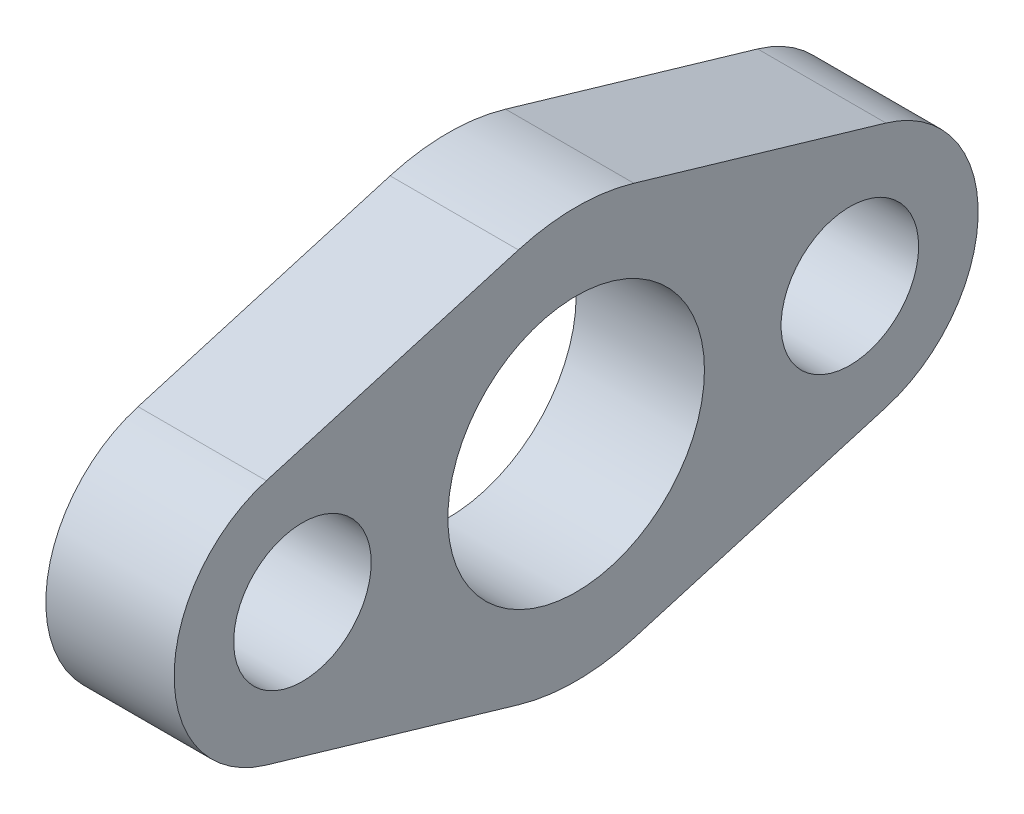
ISO-10303-21;
HEADER;
FILE_DESCRIPTION(('STEP AP214'),'2;1');
FILE_NAME('part.step','',(''),(''),'','','');
FILE_SCHEMA(('AUTOMOTIVE_DESIGN { 1 0 10303 214 1 1 1 1 }'));
ENDSEC;
DATA;
#1=APPLICATION_CONTEXT('core data for automotive mechanical design processes');
#2=APPLICATION_PROTOCOL_DEFINITION('international standard','automotive_design',2000,#1);
#3=PRODUCT_CONTEXT('',#1,'mechanical');
#4=PRODUCT('Part','Part','',(#3));
#5=PRODUCT_RELATED_PRODUCT_CATEGORY('part','',(#4));
#6=PRODUCT_DEFINITION_FORMATION('','',#4);
#7=PRODUCT_DEFINITION_CONTEXT('part definition',#1,'design');
#8=PRODUCT_DEFINITION('design','',#6,#7);
#9=PRODUCT_DEFINITION_SHAPE('','',#8);
#10=(LENGTH_UNIT() NAMED_UNIT(*) SI_UNIT(.MILLI.,.METRE.));
#11=(NAMED_UNIT(*) PLANE_ANGLE_UNIT() SI_UNIT($,.RADIAN.));
#12=(NAMED_UNIT(*) SI_UNIT($,.STERADIAN.) SOLID_ANGLE_UNIT());
#13=UNCERTAINTY_MEASURE_WITH_UNIT(LENGTH_MEASURE(1.E-05),#10,'distance_accuracy_value','');
#14=(GEOMETRIC_REPRESENTATION_CONTEXT(3) GLOBAL_UNCERTAINTY_ASSIGNED_CONTEXT((#13)) GLOBAL_UNIT_ASSIGNED_CONTEXT((#10,
#11,#12)) REPRESENTATION_CONTEXT('',''));
#15=CARTESIAN_POINT('',(0.,0.,0.));
#16=DIRECTION('',(0.,0.,1.));
#17=DIRECTION('',(1.,0.,0.));
#18=AXIS2_PLACEMENT_3D('',#15,#16,#17);
#19=CARTESIAN_POINT('',(-1.58749999999999,25.4,-139.32677028468));
#20=DIRECTION('',(1.,0.,0.));
#21=DIRECTION('',(0.,0.,-1.));
#22=AXIS2_PLACEMENT_3D('',#19,#20,#21);
#23=PLANE('',#22);
#24=CARTESIAN_POINT('',(-1.58749999999999,25.4,-139.32677028468));
#25=DIRECTION('',(-1.,0.,0.));
#26=DIRECTION('',(0.,0.,-1.));
#27=AXIS2_PLACEMENT_3D('',#24,#25,#26);
#28=CIRCLE('',#27,7.62000000000001);
#29=CARTESIAN_POINT('',(-1.58749999999999,32.7124151437384,-137.18364528468));
#30=VERTEX_POINT('',#29);
#31=CARTESIAN_POINT('',(-1.58749999999999,32.7124151437384,-141.46989528468));
#32=VERTEX_POINT('',#31);
#33=EDGE_CURVE('E155',#30,#32,#28,.T.);
#34=ORIENTED_EDGE('',*,*,#33,.T.);
#35=DIRECTION('',(0.,-0.28125,-0.959634533299005));
#36=VECTOR('',#35,1.);
#37=CARTESIAN_POINT('',(-1.58749999999999,29.9702594648365,-150.82622340968));
#38=LINE('',#37,#36);
#39=CARTESIAN_POINT('',(-1.58749999999999,29.9702594648365,-150.82622340968));
#40=VERTEX_POINT('',#39);
#41=EDGE_CURVE('E181',#32,#40,#38,.T.);
#42=ORIENTED_EDGE('',*,*,#41,.T.);
#43=CARTESIAN_POINT('',(-1.58749999999999,25.4,-149.48677028468));
#44=DIRECTION('',(-1.,0.,0.));
#45=DIRECTION('',(0.,0.,-1.));
#46=AXIS2_PLACEMENT_3D('',#43,#44,#45);
#47=CIRCLE('',#46,4.7625);
#48=CARTESIAN_POINT('',(-1.58749999999999,20.8297405351635,-150.82622340968));
#49=VERTEX_POINT('',#48);
#50=EDGE_CURVE('E168',#40,#49,#47,.T.);
#51=ORIENTED_EDGE('',*,*,#50,.T.);
#52=DIRECTION('',(0.,-0.28125,0.959634533299005));
#53=VECTOR('',#52,1.);
#54=CARTESIAN_POINT('',(-1.58749999999999,18.0875848562616,-141.46989528468));
#55=LINE('',#54,#53);
#56=CARTESIAN_POINT('',(-1.58749999999999,18.0875848562616,-141.46989528468));
#57=VERTEX_POINT('',#56);
#58=EDGE_CURVE('E130',#49,#57,#55,.T.);
#59=ORIENTED_EDGE('',*,*,#58,.T.);
#60=CARTESIAN_POINT('',(-1.58749999999999,25.4,-139.32677028468));
#61=DIRECTION('',(-1.,0.,0.));
#62=DIRECTION('',(0.,0.,-1.));
#63=AXIS2_PLACEMENT_3D('',#60,#61,#62);
#64=CIRCLE('',#63,7.62);
#65=CARTESIAN_POINT('',(-1.58749999999999,18.0875848562616,-137.18364528468));
#66=VERTEX_POINT('',#65);
#67=EDGE_CURVE('E128',#57,#66,#64,.T.);
#68=ORIENTED_EDGE('',*,*,#67,.T.);
#69=DIRECTION('',(0.,0.281249999999999,0.959634533299006));
#70=VECTOR('',#69,1.);
#71=CARTESIAN_POINT('',(-1.58749999999999,20.8297405351635,-127.82731715968));
#72=LINE('',#71,#70);
#73=CARTESIAN_POINT('',(-1.58749999999999,20.8297405351635,-127.82731715968));
#74=VERTEX_POINT('',#73);
#75=EDGE_CURVE('E110',#66,#74,#72,.T.);
#76=ORIENTED_EDGE('',*,*,#75,.T.);
#77=CARTESIAN_POINT('',(-1.58749999999999,25.4,-129.16677028468));
#78=DIRECTION('',(-1.,0.,0.));
#79=DIRECTION('',(0.,0.,-1.));
#80=AXIS2_PLACEMENT_3D('',#77,#78,#79);
#81=CIRCLE('',#80,4.7625);
#82=CARTESIAN_POINT('',(-1.58749999999999,29.9702594648365,-127.82731715968));
#83=VERTEX_POINT('',#82);
#84=EDGE_CURVE('E119',#74,#83,#81,.T.);
#85=ORIENTED_EDGE('',*,*,#84,.T.);
#86=DIRECTION('',(0.,0.281250000000001,-0.959634533299005));
#87=VECTOR('',#86,1.);
#88=CARTESIAN_POINT('',(-1.58749999999999,32.7124151437384,-137.18364528468));
#89=LINE('',#88,#87);
#90=EDGE_CURVE('E122',#83,#30,#89,.T.);
#91=ORIENTED_EDGE('',*,*,#90,.T.);
#92=EDGE_LOOP('',(#34,#42,#51,#59,#68,#76,#85,#91));
#93=FACE_BOUND('',#92,.T.);
#94=CARTESIAN_POINT('',(-1.58749999999999,25.4,-139.32677028468));
#95=DIRECTION('',(-1.,0.,0.));
#96=DIRECTION('',(0.,0.,1.));
#97=AXIS2_PLACEMENT_3D('',#94,#95,#96);
#98=CIRCLE('',#97,4.76250000000001);
#99=CARTESIAN_POINT('',(-1.58749999999999,25.4,-144.08927028468));
#100=VERTEX_POINT('',#99);
#101=EDGE_CURVE('E138',#100,#100,#98,.T.);
#102=ORIENTED_EDGE('',*,*,#101,.F.);
#103=EDGE_LOOP('',(#102));
#104=FACE_BOUND('',#103,.T.);
#105=CARTESIAN_POINT('',(-1.58749999999999,25.4,-149.48677028468));
#106=DIRECTION('',(-1.,0.,0.));
#107=DIRECTION('',(0.,0.,1.));
#108=AXIS2_PLACEMENT_3D('',#105,#106,#107);
#109=CIRCLE('',#108,2.55269999999998);
#110=CARTESIAN_POINT('',(-1.58749999999999,25.4,-152.03947028468));
#111=VERTEX_POINT('',#110);
#112=EDGE_CURVE('E189',#111,#111,#109,.T.);
#113=ORIENTED_EDGE('',*,*,#112,.F.);
#114=EDGE_LOOP('',(#113));
#115=FACE_BOUND('',#114,.T.);
#116=CARTESIAN_POINT('',(-1.58749999999999,25.4,-129.16677028468));
#117=DIRECTION('',(-1.,0.,0.));
#118=DIRECTION('',(0.,0.,1.));
#119=AXIS2_PLACEMENT_3D('',#116,#117,#118);
#120=CIRCLE('',#119,2.55269999999998);
#121=CARTESIAN_POINT('',(-1.58749999999999,25.4,-131.71947028468));
#122=VERTEX_POINT('',#121);
#123=EDGE_CURVE('E195',#122,#122,#120,.T.);
#124=ORIENTED_EDGE('',*,*,#123,.F.);
#125=EDGE_LOOP('',(#124));
#126=FACE_BOUND('',#125,.T.);
#127=ADVANCED_FACE('F39',(#93,#104,#115,#126),#23,.F.);
#128=CARTESIAN_POINT('',(3.17500000000001,25.4,-139.32677028468));
#129=DIRECTION('',(1.,0.,0.));
#130=DIRECTION('',(0.,0.,-1.));
#131=AXIS2_PLACEMENT_3D('',#128,#129,#130);
#132=PLANE('',#131);
#133=CARTESIAN_POINT('',(3.17500000000001,25.4,-149.48677028468));
#134=DIRECTION('',(-1.,0.,0.));
#135=DIRECTION('',(0.,0.,1.));
#136=AXIS2_PLACEMENT_3D('',#133,#134,#135);
#137=CIRCLE('',#136,2.55269999999998);
#138=CARTESIAN_POINT('',(3.17500000000001,25.4,-152.03947028468));
#139=VERTEX_POINT('',#138);
#140=EDGE_CURVE('E192',#139,#139,#137,.T.);
#141=ORIENTED_EDGE('',*,*,#140,.T.);
#142=EDGE_LOOP('',(#141));
#143=FACE_BOUND('',#142,.T.);
#144=CARTESIAN_POINT('',(3.17500000000001,25.4,-139.32677028468));
#145=DIRECTION('',(-1.,0.,0.));
#146=DIRECTION('',(0.,0.,-1.));
#147=AXIS2_PLACEMENT_3D('',#144,#145,#146);
#148=CIRCLE('',#147,7.62000000000001);
#149=CARTESIAN_POINT('',(3.17500000000001,32.7124151437384,-137.18364528468));
#150=VERTEX_POINT('',#149);
#151=CARTESIAN_POINT('',(3.17500000000001,32.7124151437384,-141.46989528468));
#152=VERTEX_POINT('',#151);
#153=EDGE_CURVE('E135',#150,#152,#148,.T.);
#154=ORIENTED_EDGE('',*,*,#153,.F.);
#155=DIRECTION('',(0.,0.281250000000001,-0.959634533299005));
#156=VECTOR('',#155,1.);
#157=CARTESIAN_POINT('',(3.17500000000001,32.7124151437384,-137.18364528468));
#158=LINE('',#157,#156);
#159=CARTESIAN_POINT('',(3.17500000000001,29.9702594648365,-127.82731715968));
#160=VERTEX_POINT('',#159);
#161=EDGE_CURVE('E153',#160,#150,#158,.T.);
#162=ORIENTED_EDGE('',*,*,#161,.F.);
#163=CARTESIAN_POINT('',(3.17500000000001,25.4,-129.16677028468));
#164=DIRECTION('',(-1.,0.,0.));
#165=DIRECTION('',(0.,0.,-1.));
#166=AXIS2_PLACEMENT_3D('',#163,#164,#165);
#167=CIRCLE('',#166,4.7625);
#168=CARTESIAN_POINT('',(3.17500000000001,20.8297405351635,-127.82731715968));
#169=VERTEX_POINT('',#168);
#170=EDGE_CURVE('E151',#169,#160,#167,.T.);
#171=ORIENTED_EDGE('',*,*,#170,.F.);
#172=DIRECTION('',(0.,0.281249999999999,0.959634533299006));
#173=VECTOR('',#172,1.);
#174=CARTESIAN_POINT('',(3.17500000000001,20.8297405351635,-127.82731715968));
#175=LINE('',#174,#173);
#176=CARTESIAN_POINT('',(3.17500000000001,18.0875848562616,-137.18364528468));
#177=VERTEX_POINT('',#176);
#178=EDGE_CURVE('E113',#177,#169,#175,.T.);
#179=ORIENTED_EDGE('',*,*,#178,.F.);
#180=CARTESIAN_POINT('',(3.17500000000001,25.4,-139.32677028468));
#181=DIRECTION('',(-1.,0.,0.));
#182=DIRECTION('',(0.,0.,-1.));
#183=AXIS2_PLACEMENT_3D('',#180,#181,#182);
#184=CIRCLE('',#183,7.62);
#185=CARTESIAN_POINT('',(3.17500000000001,18.0875848562616,-141.46989528468));
#186=VERTEX_POINT('',#185);
#187=EDGE_CURVE('E147',#186,#177,#184,.T.);
#188=ORIENTED_EDGE('',*,*,#187,.F.);
#189=DIRECTION('',(0.,-0.28125,0.959634533299005));
#190=VECTOR('',#189,1.);
#191=CARTESIAN_POINT('',(3.17500000000001,18.0875848562616,-141.46989528468));
#192=LINE('',#191,#190);
#193=CARTESIAN_POINT('',(3.17500000000001,20.8297405351635,-150.82622340968));
#194=VERTEX_POINT('',#193);
#195=EDGE_CURVE('E144',#194,#186,#192,.T.);
#196=ORIENTED_EDGE('',*,*,#195,.F.);
#197=CARTESIAN_POINT('',(3.17500000000001,25.4,-149.48677028468));
#198=DIRECTION('',(-1.,0.,0.));
#199=DIRECTION('',(0.,0.,-1.));
#200=AXIS2_PLACEMENT_3D('',#197,#198,#199);
#201=CIRCLE('',#200,4.7625);
#202=CARTESIAN_POINT('',(3.17500000000001,29.9702594648365,-150.82622340968));
#203=VERTEX_POINT('',#202);
#204=EDGE_CURVE('E141',#203,#194,#201,.T.);
#205=ORIENTED_EDGE('',*,*,#204,.F.);
#206=DIRECTION('',(0.,-0.28125,-0.959634533299005));
#207=VECTOR('',#206,1.);
#208=CARTESIAN_POINT('',(3.17500000000001,29.9702594648365,-150.82622340968));
#209=LINE('',#208,#207);
#210=EDGE_CURVE('E137',#152,#203,#209,.T.);
#211=ORIENTED_EDGE('',*,*,#210,.F.);
#212=EDGE_LOOP('',(#154,#162,#171,#179,#188,#196,#205,#211));
#213=FACE_BOUND('',#212,.T.);
#214=CARTESIAN_POINT('',(3.17500000000001,25.4,-139.32677028468));
#215=DIRECTION('',(-1.,0.,0.));
#216=DIRECTION('',(0.,0.,1.));
#217=AXIS2_PLACEMENT_3D('',#214,#215,#216);
#218=CIRCLE('',#217,4.76250000000001);
#219=CARTESIAN_POINT('',(3.17500000000001,25.4,-144.08927028468));
#220=VERTEX_POINT('',#219);
#221=EDGE_CURVE('E186',#220,#220,#218,.T.);
#222=ORIENTED_EDGE('',*,*,#221,.T.);
#223=EDGE_LOOP('',(#222));
#224=FACE_BOUND('',#223,.T.);
#225=CARTESIAN_POINT('',(3.17500000000001,25.4,-129.16677028468));
#226=DIRECTION('',(-1.,0.,0.));
#227=DIRECTION('',(0.,0.,1.));
#228=AXIS2_PLACEMENT_3D('',#225,#226,#227);
#229=CIRCLE('',#228,2.55269999999998);
#230=CARTESIAN_POINT('',(3.17500000000001,25.4,-131.71947028468));
#231=VERTEX_POINT('',#230);
#232=EDGE_CURVE('E198',#231,#231,#229,.T.);
#233=ORIENTED_EDGE('',*,*,#232,.T.);
#234=EDGE_LOOP('',(#233));
#235=FACE_BOUND('',#234,.T.);
#236=ADVANCED_FACE('F175',(#143,#213,#224,#235),#132,.T.);
#237=CARTESIAN_POINT('',(-1.58749999999999,25.4,-139.32677028468));
#238=DIRECTION('',(1.,0.,0.));
#239=DIRECTION('',(0.,0.,-1.));
#240=AXIS2_PLACEMENT_3D('',#237,#238,#239);
#241=CYLINDRICAL_SURFACE('',#240,7.62000000000001);
#242=ORIENTED_EDGE('',*,*,#153,.T.);
#243=DIRECTION('',(1.,0.,0.));
#244=VECTOR('',#243,1.);
#245=CARTESIAN_POINT('',(-1.58749999999999,32.7124151437384,-141.46989528468));
#246=LINE('',#245,#244);
#247=EDGE_CURVE('E11',#32,#152,#246,.T.);
#248=ORIENTED_EDGE('',*,*,#247,.F.);
#249=ORIENTED_EDGE('',*,*,#33,.F.);
#250=DIRECTION('',(1.,0.,0.));
#251=VECTOR('',#250,1.);
#252=CARTESIAN_POINT('',(-1.58749999999999,32.7124151437384,-137.18364528468));
#253=LINE('',#252,#251);
#254=EDGE_CURVE('E56',#30,#150,#253,.T.);
#255=ORIENTED_EDGE('',*,*,#254,.T.);
#256=EDGE_LOOP('',(#242,#248,#249,#255));
#257=FACE_BOUND('',#256,.T.);
#258=ADVANCED_FACE('F41',(#257),#241,.T.);
#259=CARTESIAN_POINT('',(-1.58749999999999,29.9702594648365,-150.82622340968));
#260=DIRECTION('',(0.,-0.959634533299005,0.28125));
#261=DIRECTION('',(0.,-0.28125,-0.959634533299005));
#262=AXIS2_PLACEMENT_3D('',#259,#260,#261);
#263=PLANE('',#262);
#264=ORIENTED_EDGE('',*,*,#210,.T.);
#265=DIRECTION('',(1.,0.,0.));
#266=VECTOR('',#265,1.);
#267=CARTESIAN_POINT('',(-1.58749999999999,29.9702594648365,-150.82622340968));
#268=LINE('',#267,#266);
#269=EDGE_CURVE('E48',#40,#203,#268,.T.);
#270=ORIENTED_EDGE('',*,*,#269,.F.);
#271=ORIENTED_EDGE('',*,*,#41,.F.);
#272=ORIENTED_EDGE('',*,*,#247,.T.);
#273=EDGE_LOOP('',(#264,#270,#271,#272));
#274=FACE_BOUND('',#273,.T.);
#275=ADVANCED_FACE('F172',(#274),#263,.F.);
#276=CARTESIAN_POINT('',(-1.58749999999999,25.4,-149.48677028468));
#277=DIRECTION('',(1.,0.,0.));
#278=DIRECTION('',(0.,0.,-1.));
#279=AXIS2_PLACEMENT_3D('',#276,#277,#278);
#280=CYLINDRICAL_SURFACE('',#279,4.7625);
#281=ORIENTED_EDGE('',*,*,#204,.T.);
#282=DIRECTION('',(1.,0.,0.));
#283=VECTOR('',#282,1.);
#284=CARTESIAN_POINT('',(-1.58749999999999,20.8297405351635,-150.82622340968));
#285=LINE('',#284,#283);
#286=EDGE_CURVE('E161',#49,#194,#285,.T.);
#287=ORIENTED_EDGE('',*,*,#286,.F.);
#288=ORIENTED_EDGE('',*,*,#50,.F.);
#289=ORIENTED_EDGE('',*,*,#269,.T.);
#290=EDGE_LOOP('',(#281,#287,#288,#289));
#291=FACE_BOUND('',#290,.T.);
#292=ADVANCED_FACE('F164',(#291),#280,.T.);
#293=CARTESIAN_POINT('',(-1.58749999999999,18.0875848562616,-141.46989528468));
#294=DIRECTION('',(0.,0.959634533299005,0.28125));
#295=DIRECTION('',(0.,-0.28125,0.959634533299005));
#296=AXIS2_PLACEMENT_3D('',#293,#294,#295);
#297=PLANE('',#296);
#298=ORIENTED_EDGE('',*,*,#195,.T.);
#299=DIRECTION('',(1.,0.,0.));
#300=VECTOR('',#299,1.);
#301=CARTESIAN_POINT('',(-1.58749999999999,18.0875848562616,-141.46989528468));
#302=LINE('',#301,#300);
#303=EDGE_CURVE('E159',#57,#186,#302,.T.);
#304=ORIENTED_EDGE('',*,*,#303,.F.);
#305=ORIENTED_EDGE('',*,*,#58,.F.);
#306=ORIENTED_EDGE('',*,*,#286,.T.);
#307=EDGE_LOOP('',(#298,#304,#305,#306));
#308=FACE_BOUND('',#307,.T.);
#309=ADVANCED_FACE('F179',(#308),#297,.F.);
#310=CARTESIAN_POINT('',(-1.58749999999999,25.4,-139.32677028468));
#311=DIRECTION('',(1.,0.,0.));
#312=DIRECTION('',(0.,0.,-1.));
#313=AXIS2_PLACEMENT_3D('',#310,#311,#312);
#314=CYLINDRICAL_SURFACE('',#313,7.62);
#315=ORIENTED_EDGE('',*,*,#187,.T.);
#316=DIRECTION('',(1.,0.,0.));
#317=VECTOR('',#316,1.);
#318=CARTESIAN_POINT('',(-1.58749999999999,18.0875848562616,-137.18364528468));
#319=LINE('',#318,#317);
#320=EDGE_CURVE('E116',#66,#177,#319,.T.);
#321=ORIENTED_EDGE('',*,*,#320,.F.);
#322=ORIENTED_EDGE('',*,*,#67,.F.);
#323=ORIENTED_EDGE('',*,*,#303,.T.);
#324=EDGE_LOOP('',(#315,#321,#322,#323));
#325=FACE_BOUND('',#324,.T.);
#326=ADVANCED_FACE('F225',(#325),#314,.T.);
#327=CARTESIAN_POINT('',(-1.58749999999999,20.8297405351635,-127.82731715968));
#328=DIRECTION('',(0.,0.959634533299006,-0.281249999999999));
#329=DIRECTION('',(0.,0.281249999999999,0.959634533299006));
#330=AXIS2_PLACEMENT_3D('',#327,#328,#329);
#331=PLANE('',#330);
#332=ORIENTED_EDGE('',*,*,#178,.T.);
#333=DIRECTION('',(1.,0.,0.));
#334=VECTOR('',#333,1.);
#335=CARTESIAN_POINT('',(-1.58749999999999,20.8297405351635,-127.82731715968));
#336=LINE('',#335,#334);
#337=EDGE_CURVE('E106',#74,#169,#336,.T.);
#338=ORIENTED_EDGE('',*,*,#337,.F.);
#339=ORIENTED_EDGE('',*,*,#75,.F.);
#340=ORIENTED_EDGE('',*,*,#320,.T.);
#341=EDGE_LOOP('',(#332,#338,#339,#340));
#342=FACE_BOUND('',#341,.T.);
#343=ADVANCED_FACE('F108',(#342),#331,.F.);
#344=CARTESIAN_POINT('',(-1.58749999999999,25.4,-129.16677028468));
#345=DIRECTION('',(1.,0.,0.));
#346=DIRECTION('',(0.,0.,-1.));
#347=AXIS2_PLACEMENT_3D('',#344,#345,#346);
#348=CYLINDRICAL_SURFACE('',#347,4.7625);
#349=ORIENTED_EDGE('',*,*,#170,.T.);
#350=DIRECTION('',(1.,0.,0.));
#351=VECTOR('',#350,1.);
#352=CARTESIAN_POINT('',(-1.58749999999999,29.9702594648365,-127.82731715968));
#353=LINE('',#352,#351);
#354=EDGE_CURVE('E81',#83,#160,#353,.T.);
#355=ORIENTED_EDGE('',*,*,#354,.F.);
#356=ORIENTED_EDGE('',*,*,#84,.F.);
#357=ORIENTED_EDGE('',*,*,#337,.T.);
#358=EDGE_LOOP('',(#349,#355,#356,#357));
#359=FACE_BOUND('',#358,.T.);
#360=ADVANCED_FACE('F120',(#359),#348,.T.);
#361=CARTESIAN_POINT('',(-1.58749999999999,32.7124151437384,-137.18364528468));
#362=DIRECTION('',(0.,-0.959634533299005,-0.281250000000001));
#363=DIRECTION('',(0.,0.281250000000001,-0.959634533299005));
#364=AXIS2_PLACEMENT_3D('',#361,#362,#363);
#365=PLANE('',#364);
#366=ORIENTED_EDGE('',*,*,#161,.T.);
#367=ORIENTED_EDGE('',*,*,#254,.F.);
#368=ORIENTED_EDGE('',*,*,#90,.F.);
#369=ORIENTED_EDGE('',*,*,#354,.T.);
#370=EDGE_LOOP('',(#366,#367,#368,#369));
#371=FACE_BOUND('',#370,.T.);
#372=ADVANCED_FACE('F218',(#371),#365,.F.);
#373=CARTESIAN_POINT('',(-1.58749999999999,25.4,-139.32677028468));
#374=DIRECTION('',(1.,0.,0.));
#375=DIRECTION('',(0.,0.,-1.));
#376=AXIS2_PLACEMENT_3D('',#373,#374,#375);
#377=CYLINDRICAL_SURFACE('',#376,4.76250000000001);
#378=CARTESIAN_POINT('',(-1.58749999999999,25.4,-144.08927028468));
#379=CARTESIAN_POINT('',(-1.53789062499999,25.4,-144.08927028468));
#380=CARTESIAN_POINT('',(-1.48828124999999,25.4,-144.08927028468));
#381=CARTESIAN_POINT('',(-1.38906249999999,25.4,-144.08927028468));
#382=CARTESIAN_POINT('',(-1.33945312499999,25.4,-144.08927028468));
#383=CARTESIAN_POINT('',(-1.24023437499999,25.4,-144.08927028468));
#384=CARTESIAN_POINT('',(-1.19062499999999,25.4,-144.08927028468));
#385=CARTESIAN_POINT('',(-1.09140624999999,25.4,-144.08927028468));
#386=CARTESIAN_POINT('',(-1.04179687499999,25.4,-144.08927028468));
#387=CARTESIAN_POINT('',(-0.942578124999991,25.4,-144.08927028468));
#388=CARTESIAN_POINT('',(-0.892968749999991,25.4,-144.08927028468));
#389=CARTESIAN_POINT('',(-0.793749999999991,25.4,-144.08927028468));
#390=CARTESIAN_POINT('',(-0.744140624999991,25.4,-144.08927028468));
#391=CARTESIAN_POINT('',(-0.644921874999991,25.4,-144.08927028468));
#392=CARTESIAN_POINT('',(-0.595312499999991,25.4,-144.08927028468));
#393=CARTESIAN_POINT('',(-0.496093749999991,25.4,-144.08927028468));
#394=CARTESIAN_POINT('',(-0.446484374999991,25.4,-144.08927028468));
#395=CARTESIAN_POINT('',(-0.347265624999991,25.4,-144.08927028468));
#396=CARTESIAN_POINT('',(-0.297656249999991,25.4,-144.08927028468));
#397=CARTESIAN_POINT('',(-0.198437499999991,25.4,-144.08927028468));
#398=CARTESIAN_POINT('',(-0.148828124999991,25.4,-144.08927028468));
#399=CARTESIAN_POINT('',(-0.0496093749999905,25.4,-144.08927028468));
#400=CARTESIAN_POINT('',(0.,25.4,-144.08927028468));
#401=CARTESIAN_POINT('',(0.0992187500000097,25.4,-144.08927028468));
#402=CARTESIAN_POINT('',(0.14882812500001,25.4,-144.08927028468));
#403=CARTESIAN_POINT('',(0.24804687500001,25.4,-144.08927028468));
#404=CARTESIAN_POINT('',(0.29765625000001,25.4,-144.08927028468));
#405=CARTESIAN_POINT('',(0.39687500000001,25.4,-144.08927028468));
#406=CARTESIAN_POINT('',(0.44648437500001,25.4,-144.08927028468));
#407=CARTESIAN_POINT('',(0.54570312500001,25.4,-144.08927028468));
#408=CARTESIAN_POINT('',(0.59531250000001,25.4,-144.08927028468));
#409=CARTESIAN_POINT('',(0.69453125000001,25.4,-144.08927028468));
#410=CARTESIAN_POINT('',(0.74414062500001,25.4,-144.08927028468));
#411=CARTESIAN_POINT('',(0.84335937500001,25.4,-144.08927028468));
#412=CARTESIAN_POINT('',(0.89296875000001,25.4,-144.08927028468));
#413=CARTESIAN_POINT('',(0.99218750000001,25.4,-144.08927028468));
#414=CARTESIAN_POINT('',(1.04179687500001,25.4,-144.08927028468));
#415=CARTESIAN_POINT('',(1.14101562500001,25.4,-144.08927028468));
#416=CARTESIAN_POINT('',(1.19062500000001,25.4,-144.08927028468));
#417=CARTESIAN_POINT('',(1.28984375000001,25.4,-144.08927028468));
#418=CARTESIAN_POINT('',(1.33945312500001,25.4,-144.08927028468));
#419=CARTESIAN_POINT('',(1.43867187500001,25.4,-144.08927028468));
#420=CARTESIAN_POINT('',(1.48828125000001,25.4,-144.08927028468));
#421=CARTESIAN_POINT('',(1.58750000000001,25.4,-144.08927028468));
#422=CARTESIAN_POINT('',(1.63710937500001,25.4,-144.08927028468));
#423=CARTESIAN_POINT('',(1.73632812500001,25.4,-144.08927028468));
#424=CARTESIAN_POINT('',(1.78593750000001,25.4,-144.08927028468));
#425=CARTESIAN_POINT('',(1.88515625000001,25.4,-144.08927028468));
#426=CARTESIAN_POINT('',(1.93476562500001,25.4,-144.08927028468));
#427=CARTESIAN_POINT('',(2.03398437500001,25.4,-144.08927028468));
#428=CARTESIAN_POINT('',(2.08359375000001,25.4,-144.08927028468));
#429=CARTESIAN_POINT('',(2.18281250000001,25.4,-144.08927028468));
#430=CARTESIAN_POINT('',(2.23242187500001,25.4,-144.08927028468));
#431=CARTESIAN_POINT('',(2.33164062500001,25.4,-144.08927028468));
#432=CARTESIAN_POINT('',(2.38125000000001,25.4,-144.08927028468));
#433=CARTESIAN_POINT('',(2.48046875000001,25.4,-144.08927028468));
#434=CARTESIAN_POINT('',(2.53007812500001,25.4,-144.08927028468));
#435=CARTESIAN_POINT('',(2.62929687500001,25.4,-144.08927028468));
#436=CARTESIAN_POINT('',(2.67890625000001,25.4,-144.08927028468));
#437=CARTESIAN_POINT('',(2.77812500000001,25.4,-144.08927028468));
#438=CARTESIAN_POINT('',(2.82773437500001,25.4,-144.08927028468));
#439=CARTESIAN_POINT('',(2.92695312500001,25.4,-144.08927028468));
#440=CARTESIAN_POINT('',(2.97656250000001,25.4,-144.08927028468));
#441=CARTESIAN_POINT('',(3.07578125000001,25.4,-144.08927028468));
#442=CARTESIAN_POINT('',(3.12539062500001,25.4,-144.08927028468));
#443=CARTESIAN_POINT('',(3.17500000000001,25.4,-144.08927028468));
#444=B_SPLINE_CURVE_WITH_KNOTS('',3,(#378,#379,#380,#381,#382,#383,#384,#385,#386,#387,#388,
#389,#390,#391,#392,#393,#394,#395,#396,#397,#398,#399,#400,#401,#402,#403,#404,#405,#406,#407,
#408,#409,#410,#411,#412,#413,#414,#415,#416,#417,#418,#419,#420,#421,#422,#423,#424,#425,#426,
#427,#428,#429,#430,#431,#432,#433,#434,#435,#436,#437,#438,#439,#440,#441,#442,#443),
.UNSPECIFIED.,.F.,.F.,(4,2,2,2,2,2,2,2,2,2,2,2,2,2,2,2,2,2,2,2,2,2,2,2,2,2,2,2,2,2,2,2,4),(0.,
0.148828125,0.29765625,0.446484375,0.595312500000001,0.744140625000001,0.892968750000001,
1.041796875,1.190625,1.339453125,1.48828125,1.637109375,1.7859375,1.934765625,2.08359375,
2.232421875,2.38125,2.530078125,2.67890625,2.827734375,2.9765625,3.125390625,3.27421875,
3.423046875,3.571875,3.720703125,3.86953125,4.018359375,4.1671875,4.316015625,4.46484375,
4.613671875,4.7625),.UNSPECIFIED.);
#445=EDGE_CURVE('BSEAM215',#100,#220,#444,.T.);
#446=ORIENTED_EDGE('',*,*,#101,.T.);
#447=ORIENTED_EDGE('',*,*,#221,.F.);
#448=ORIENTED_EDGE('',*,*,#445,.T.);
#449=ORIENTED_EDGE('',*,*,#445,.F.);
#450=EDGE_LOOP('',(#446,#448,#447,#449));
#451=FACE_BOUND('',#450,.T.);
#452=ADVANCED_FACE('F215',(#451),#377,.F.);
#453=CARTESIAN_POINT('',(-1.58749999999999,25.4,-149.48677028468));
#454=DIRECTION('',(1.,0.,0.));
#455=DIRECTION('',(0.,0.,-1.));
#456=AXIS2_PLACEMENT_3D('',#453,#454,#455);
#457=CYLINDRICAL_SURFACE('',#456,2.55269999999998);
#458=CARTESIAN_POINT('',(-1.58749999999999,25.4,-152.03947028468));
#459=CARTESIAN_POINT('',(-1.53789062499999,25.4,-152.03947028468));
#460=CARTESIAN_POINT('',(-1.48828124999999,25.4,-152.03947028468));
#461=CARTESIAN_POINT('',(-1.38906249999999,25.4,-152.03947028468));
#462=CARTESIAN_POINT('',(-1.33945312499999,25.4,-152.03947028468));
#463=CARTESIAN_POINT('',(-1.24023437499999,25.4,-152.03947028468));
#464=CARTESIAN_POINT('',(-1.19062499999999,25.4,-152.03947028468));
#465=CARTESIAN_POINT('',(-1.09140624999999,25.4,-152.03947028468));
#466=CARTESIAN_POINT('',(-1.04179687499999,25.4,-152.03947028468));
#467=CARTESIAN_POINT('',(-0.942578124999991,25.4,-152.03947028468));
#468=CARTESIAN_POINT('',(-0.892968749999991,25.4,-152.03947028468));
#469=CARTESIAN_POINT('',(-0.793749999999991,25.4,-152.03947028468));
#470=CARTESIAN_POINT('',(-0.744140624999991,25.4,-152.03947028468));
#471=CARTESIAN_POINT('',(-0.644921874999991,25.4,-152.03947028468));
#472=CARTESIAN_POINT('',(-0.595312499999991,25.4,-152.03947028468));
#473=CARTESIAN_POINT('',(-0.496093749999991,25.4,-152.03947028468));
#474=CARTESIAN_POINT('',(-0.446484374999991,25.4,-152.03947028468));
#475=CARTESIAN_POINT('',(-0.347265624999991,25.4,-152.03947028468));
#476=CARTESIAN_POINT('',(-0.297656249999991,25.4,-152.03947028468));
#477=CARTESIAN_POINT('',(-0.198437499999991,25.4,-152.03947028468));
#478=CARTESIAN_POINT('',(-0.148828124999991,25.4,-152.03947028468));
#479=CARTESIAN_POINT('',(-0.0496093749999905,25.4,-152.03947028468));
#480=CARTESIAN_POINT('',(0.,25.4,-152.03947028468));
#481=CARTESIAN_POINT('',(0.0992187500000097,25.4,-152.03947028468));
#482=CARTESIAN_POINT('',(0.14882812500001,25.4,-152.03947028468));
#483=CARTESIAN_POINT('',(0.24804687500001,25.4,-152.03947028468));
#484=CARTESIAN_POINT('',(0.29765625000001,25.4,-152.03947028468));
#485=CARTESIAN_POINT('',(0.39687500000001,25.4,-152.03947028468));
#486=CARTESIAN_POINT('',(0.44648437500001,25.4,-152.03947028468));
#487=CARTESIAN_POINT('',(0.54570312500001,25.4,-152.03947028468));
#488=CARTESIAN_POINT('',(0.59531250000001,25.4,-152.03947028468));
#489=CARTESIAN_POINT('',(0.69453125000001,25.4,-152.03947028468));
#490=CARTESIAN_POINT('',(0.74414062500001,25.4,-152.03947028468));
#491=CARTESIAN_POINT('',(0.84335937500001,25.4,-152.03947028468));
#492=CARTESIAN_POINT('',(0.89296875000001,25.4,-152.03947028468));
#493=CARTESIAN_POINT('',(0.99218750000001,25.4,-152.03947028468));
#494=CARTESIAN_POINT('',(1.04179687500001,25.4,-152.03947028468));
#495=CARTESIAN_POINT('',(1.14101562500001,25.4,-152.03947028468));
#496=CARTESIAN_POINT('',(1.19062500000001,25.4,-152.03947028468));
#497=CARTESIAN_POINT('',(1.28984375000001,25.4,-152.03947028468));
#498=CARTESIAN_POINT('',(1.33945312500001,25.4,-152.03947028468));
#499=CARTESIAN_POINT('',(1.43867187500001,25.4,-152.03947028468));
#500=CARTESIAN_POINT('',(1.48828125000001,25.4,-152.03947028468));
#501=CARTESIAN_POINT('',(1.58750000000001,25.4,-152.03947028468));
#502=CARTESIAN_POINT('',(1.63710937500001,25.4,-152.03947028468));
#503=CARTESIAN_POINT('',(1.73632812500001,25.4,-152.03947028468));
#504=CARTESIAN_POINT('',(1.78593750000001,25.4,-152.03947028468));
#505=CARTESIAN_POINT('',(1.88515625000001,25.4,-152.03947028468));
#506=CARTESIAN_POINT('',(1.93476562500001,25.4,-152.03947028468));
#507=CARTESIAN_POINT('',(2.03398437500001,25.4,-152.03947028468));
#508=CARTESIAN_POINT('',(2.08359375000001,25.4,-152.03947028468));
#509=CARTESIAN_POINT('',(2.18281250000001,25.4,-152.03947028468));
#510=CARTESIAN_POINT('',(2.23242187500001,25.4,-152.03947028468));
#511=CARTESIAN_POINT('',(2.33164062500001,25.4,-152.03947028468));
#512=CARTESIAN_POINT('',(2.38125000000001,25.4,-152.03947028468));
#513=CARTESIAN_POINT('',(2.48046875000001,25.4,-152.03947028468));
#514=CARTESIAN_POINT('',(2.53007812500001,25.4,-152.03947028468));
#515=CARTESIAN_POINT('',(2.62929687500001,25.4,-152.03947028468));
#516=CARTESIAN_POINT('',(2.67890625000001,25.4,-152.03947028468));
#517=CARTESIAN_POINT('',(2.77812500000001,25.4,-152.03947028468));
#518=CARTESIAN_POINT('',(2.82773437500001,25.4,-152.03947028468));
#519=CARTESIAN_POINT('',(2.92695312500001,25.4,-152.03947028468));
#520=CARTESIAN_POINT('',(2.97656250000001,25.4,-152.03947028468));
#521=CARTESIAN_POINT('',(3.07578125000001,25.4,-152.03947028468));
#522=CARTESIAN_POINT('',(3.12539062500001,25.4,-152.03947028468));
#523=CARTESIAN_POINT('',(3.17500000000001,25.4,-152.03947028468));
#524=B_SPLINE_CURVE_WITH_KNOTS('',3,(#458,#459,#460,#461,#462,#463,#464,#465,#466,#467,#468,
#469,#470,#471,#472,#473,#474,#475,#476,#477,#478,#479,#480,#481,#482,#483,#484,#485,#486,#487,
#488,#489,#490,#491,#492,#493,#494,#495,#496,#497,#498,#499,#500,#501,#502,#503,#504,#505,#506,
#507,#508,#509,#510,#511,#512,#513,#514,#515,#516,#517,#518,#519,#520,#521,#522,#523),
.UNSPECIFIED.,.F.,.F.,(4,2,2,2,2,2,2,2,2,2,2,2,2,2,2,2,2,2,2,2,2,2,2,2,2,2,2,2,2,2,2,2,4),(0.,
0.148828125,0.29765625,0.446484375,0.595312500000001,0.744140625000001,0.892968750000001,
1.041796875,1.190625,1.339453125,1.48828125,1.637109375,1.7859375,1.934765625,2.08359375,
2.232421875,2.38125,2.530078125,2.67890625,2.827734375,2.9765625,3.125390625,3.27421875,
3.423046875,3.571875,3.720703125,3.86953125,4.018359375,4.1671875,4.316015625,4.46484375,
4.613671875,4.7625),.UNSPECIFIED.);
#525=EDGE_CURVE('BSEAM305',#111,#139,#524,.T.);
#526=ORIENTED_EDGE('',*,*,#112,.T.);
#527=ORIENTED_EDGE('',*,*,#140,.F.);
#528=ORIENTED_EDGE('',*,*,#525,.T.);
#529=ORIENTED_EDGE('',*,*,#525,.F.);
#530=EDGE_LOOP('',(#526,#528,#527,#529));
#531=FACE_BOUND('',#530,.T.);
#532=ADVANCED_FACE('F305',(#531),#457,.F.);
#533=CARTESIAN_POINT('',(-1.58749999999999,25.4,-129.16677028468));
#534=DIRECTION('',(1.,0.,0.));
#535=DIRECTION('',(0.,0.,-1.));
#536=AXIS2_PLACEMENT_3D('',#533,#534,#535);
#537=CYLINDRICAL_SURFACE('',#536,2.55269999999998);
#538=CARTESIAN_POINT('',(-1.58749999999999,25.4,-131.71947028468));
#539=CARTESIAN_POINT('',(-1.53789062499999,25.4,-131.71947028468));
#540=CARTESIAN_POINT('',(-1.48828124999999,25.4,-131.71947028468));
#541=CARTESIAN_POINT('',(-1.38906249999999,25.4,-131.71947028468));
#542=CARTESIAN_POINT('',(-1.33945312499999,25.4,-131.71947028468));
#543=CARTESIAN_POINT('',(-1.24023437499999,25.4,-131.71947028468));
#544=CARTESIAN_POINT('',(-1.19062499999999,25.4,-131.71947028468));
#545=CARTESIAN_POINT('',(-1.09140624999999,25.4,-131.71947028468));
#546=CARTESIAN_POINT('',(-1.04179687499999,25.4,-131.71947028468));
#547=CARTESIAN_POINT('',(-0.942578124999991,25.4,-131.71947028468));
#548=CARTESIAN_POINT('',(-0.892968749999991,25.4,-131.71947028468));
#549=CARTESIAN_POINT('',(-0.793749999999991,25.4,-131.71947028468));
#550=CARTESIAN_POINT('',(-0.744140624999991,25.4,-131.71947028468));
#551=CARTESIAN_POINT('',(-0.644921874999991,25.4,-131.71947028468));
#552=CARTESIAN_POINT('',(-0.595312499999991,25.4,-131.71947028468));
#553=CARTESIAN_POINT('',(-0.496093749999991,25.4,-131.71947028468));
#554=CARTESIAN_POINT('',(-0.446484374999991,25.4,-131.71947028468));
#555=CARTESIAN_POINT('',(-0.347265624999991,25.4,-131.71947028468));
#556=CARTESIAN_POINT('',(-0.297656249999991,25.4,-131.71947028468));
#557=CARTESIAN_POINT('',(-0.198437499999991,25.4,-131.71947028468));
#558=CARTESIAN_POINT('',(-0.148828124999991,25.4,-131.71947028468));
#559=CARTESIAN_POINT('',(-0.0496093749999905,25.4,-131.71947028468));
#560=CARTESIAN_POINT('',(0.,25.4,-131.71947028468));
#561=CARTESIAN_POINT('',(0.0992187500000097,25.4,-131.71947028468));
#562=CARTESIAN_POINT('',(0.14882812500001,25.4,-131.71947028468));
#563=CARTESIAN_POINT('',(0.24804687500001,25.4,-131.71947028468));
#564=CARTESIAN_POINT('',(0.29765625000001,25.4,-131.71947028468));
#565=CARTESIAN_POINT('',(0.39687500000001,25.4,-131.71947028468));
#566=CARTESIAN_POINT('',(0.44648437500001,25.4,-131.71947028468));
#567=CARTESIAN_POINT('',(0.54570312500001,25.4,-131.71947028468));
#568=CARTESIAN_POINT('',(0.59531250000001,25.4,-131.71947028468));
#569=CARTESIAN_POINT('',(0.69453125000001,25.4,-131.71947028468));
#570=CARTESIAN_POINT('',(0.74414062500001,25.4,-131.71947028468));
#571=CARTESIAN_POINT('',(0.84335937500001,25.4,-131.71947028468));
#572=CARTESIAN_POINT('',(0.89296875000001,25.4,-131.71947028468));
#573=CARTESIAN_POINT('',(0.99218750000001,25.4,-131.71947028468));
#574=CARTESIAN_POINT('',(1.04179687500001,25.4,-131.71947028468));
#575=CARTESIAN_POINT('',(1.14101562500001,25.4,-131.71947028468));
#576=CARTESIAN_POINT('',(1.19062500000001,25.4,-131.71947028468));
#577=CARTESIAN_POINT('',(1.28984375000001,25.4,-131.71947028468));
#578=CARTESIAN_POINT('',(1.33945312500001,25.4,-131.71947028468));
#579=CARTESIAN_POINT('',(1.43867187500001,25.4,-131.71947028468));
#580=CARTESIAN_POINT('',(1.48828125000001,25.4,-131.71947028468));
#581=CARTESIAN_POINT('',(1.58750000000001,25.4,-131.71947028468));
#582=CARTESIAN_POINT('',(1.63710937500001,25.4,-131.71947028468));
#583=CARTESIAN_POINT('',(1.73632812500001,25.4,-131.71947028468));
#584=CARTESIAN_POINT('',(1.78593750000001,25.4,-131.71947028468));
#585=CARTESIAN_POINT('',(1.88515625000001,25.4,-131.71947028468));
#586=CARTESIAN_POINT('',(1.93476562500001,25.4,-131.71947028468));
#587=CARTESIAN_POINT('',(2.03398437500001,25.4,-131.71947028468));
#588=CARTESIAN_POINT('',(2.08359375000001,25.4,-131.71947028468));
#589=CARTESIAN_POINT('',(2.18281250000001,25.4,-131.71947028468));
#590=CARTESIAN_POINT('',(2.23242187500001,25.4,-131.71947028468));
#591=CARTESIAN_POINT('',(2.33164062500001,25.4,-131.71947028468));
#592=CARTESIAN_POINT('',(2.38125000000001,25.4,-131.71947028468));
#593=CARTESIAN_POINT('',(2.48046875000001,25.4,-131.71947028468));
#594=CARTESIAN_POINT('',(2.53007812500001,25.4,-131.71947028468));
#595=CARTESIAN_POINT('',(2.62929687500001,25.4,-131.71947028468));
#596=CARTESIAN_POINT('',(2.67890625000001,25.4,-131.71947028468));
#597=CARTESIAN_POINT('',(2.77812500000001,25.4,-131.71947028468));
#598=CARTESIAN_POINT('',(2.82773437500001,25.4,-131.71947028468));
#599=CARTESIAN_POINT('',(2.92695312500001,25.4,-131.71947028468));
#600=CARTESIAN_POINT('',(2.97656250000001,25.4,-131.71947028468));
#601=CARTESIAN_POINT('',(3.07578125000001,25.4,-131.71947028468));
#602=CARTESIAN_POINT('',(3.12539062500001,25.4,-131.71947028468));
#603=CARTESIAN_POINT('',(3.17500000000001,25.4,-131.71947028468));
#604=B_SPLINE_CURVE_WITH_KNOTS('',3,(#538,#539,#540,#541,#542,#543,#544,#545,#546,#547,#548,
#549,#550,#551,#552,#553,#554,#555,#556,#557,#558,#559,#560,#561,#562,#563,#564,#565,#566,#567,
#568,#569,#570,#571,#572,#573,#574,#575,#576,#577,#578,#579,#580,#581,#582,#583,#584,#585,#586,
#587,#588,#589,#590,#591,#592,#593,#594,#595,#596,#597,#598,#599,#600,#601,#602,#603),
.UNSPECIFIED.,.F.,.F.,(4,2,2,2,2,2,2,2,2,2,2,2,2,2,2,2,2,2,2,2,2,2,2,2,2,2,2,2,2,2,2,2,4),(0.,
0.148828125,0.29765625,0.446484375,0.595312500000001,0.744140625000001,0.892968750000001,
1.041796875,1.190625,1.339453125,1.48828125,1.637109375,1.7859375,1.934765625,2.08359375,
2.232421875,2.38125,2.530078125,2.67890625,2.827734375,2.9765625,3.125390625,3.27421875,
3.423046875,3.571875,3.720703125,3.86953125,4.018359375,4.1671875,4.316015625,4.46484375,
4.613671875,4.7625),.UNSPECIFIED.);
#605=EDGE_CURVE('BSEAM204',#122,#231,#604,.T.);
#606=ORIENTED_EDGE('',*,*,#123,.T.);
#607=ORIENTED_EDGE('',*,*,#232,.F.);
#608=ORIENTED_EDGE('',*,*,#605,.T.);
#609=ORIENTED_EDGE('',*,*,#605,.F.);
#610=EDGE_LOOP('',(#606,#608,#607,#609));
#611=FACE_BOUND('',#610,.T.);
#612=ADVANCED_FACE('F204',(#611),#537,.F.);
#613=CLOSED_SHELL('',(#127,#236,#258,#275,#292,#309,#326,#343,#360,#372,#452,#532,#612));
#614=MANIFOLD_SOLID_BREP('B2',#613);
#615=ADVANCED_BREP_SHAPE_REPRESENTATION('',(#18,#614),#14);
#616=SHAPE_DEFINITION_REPRESENTATION(#9,#615);
ENDSEC;
END-ISO-10303-21;
